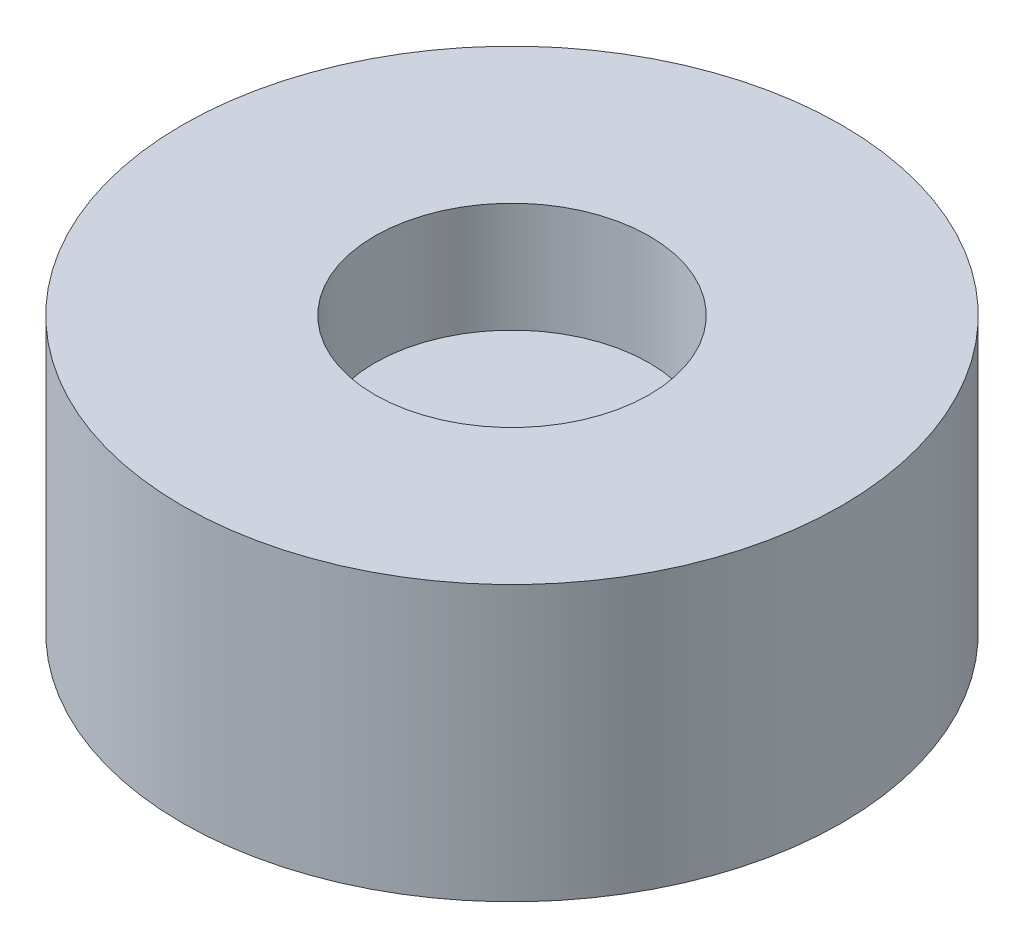
ISO-10303-21;
HEADER;
FILE_DESCRIPTION(('STEP AP214'),'2;1');
FILE_NAME('part.step','',(''),(''),'','','');
FILE_SCHEMA(('AUTOMOTIVE_DESIGN { 1 0 10303 214 1 1 1 1 }'));
ENDSEC;
DATA;
#1=APPLICATION_CONTEXT('core data for automotive mechanical design processes');
#2=APPLICATION_PROTOCOL_DEFINITION('international standard','automotive_design',2000,#1);
#3=PRODUCT_CONTEXT('',#1,'mechanical');
#4=PRODUCT('Part','Part','',(#3));
#5=PRODUCT_RELATED_PRODUCT_CATEGORY('part','',(#4));
#6=PRODUCT_DEFINITION_FORMATION('','',#4);
#7=PRODUCT_DEFINITION_CONTEXT('part definition',#1,'design');
#8=PRODUCT_DEFINITION('design','',#6,#7);
#9=PRODUCT_DEFINITION_SHAPE('','',#8);
#10=(LENGTH_UNIT() NAMED_UNIT(*) SI_UNIT(.MILLI.,.METRE.));
#11=(NAMED_UNIT(*) PLANE_ANGLE_UNIT() SI_UNIT($,.RADIAN.));
#12=(NAMED_UNIT(*) SI_UNIT($,.STERADIAN.) SOLID_ANGLE_UNIT());
#13=UNCERTAINTY_MEASURE_WITH_UNIT(LENGTH_MEASURE(1.E-05),#10,'distance_accuracy_value','');
#14=(GEOMETRIC_REPRESENTATION_CONTEXT(3) GLOBAL_UNCERTAINTY_ASSIGNED_CONTEXT((#13)) GLOBAL_UNIT_ASSIGNED_CONTEXT((#10,
#11,#12)) REPRESENTATION_CONTEXT('',''));
#15=CARTESIAN_POINT('',(0.,0.,0.));
#16=DIRECTION('',(0.,0.,1.));
#17=DIRECTION('',(1.,0.,0.));
#18=AXIS2_PLACEMENT_3D('',#15,#16,#17);
#19=CARTESIAN_POINT('',(0.,5.,0.));
#20=DIRECTION('',(0.,-1.,0.));
#21=DIRECTION('',(0.,0.,-1.));
#22=AXIS2_PLACEMENT_3D('',#19,#20,#21);
#23=CYLINDRICAL_SURFACE('',#22,6.);
#24=CARTESIAN_POINT('',(0.,5.,0.));
#25=DIRECTION('',(0.,1.,0.));
#26=DIRECTION('',(0.,0.,1.));
#27=AXIS2_PLACEMENT_3D('',#24,#25,#26);
#28=CIRCLE('',#27,6.);
#29=CARTESIAN_POINT('',(0.,5.,6.));
#30=VERTEX_POINT('',#29);
#31=EDGE_CURVE('E38',#30,#30,#28,.T.);
#32=ORIENTED_EDGE('',*,*,#31,.F.);
#33=EDGE_LOOP('',(#32));
#34=FACE_BOUND('',#33,.T.);
#35=CARTESIAN_POINT('',(0.,0.,0.));
#36=DIRECTION('',(0.,1.,0.));
#37=DIRECTION('',(0.,0.,1.));
#38=AXIS2_PLACEMENT_3D('',#35,#36,#37);
#39=CIRCLE('',#38,6.);
#40=CARTESIAN_POINT('',(0.,0.,6.));
#41=VERTEX_POINT('',#40);
#42=EDGE_CURVE('E42',#41,#41,#39,.T.);
#43=ORIENTED_EDGE('',*,*,#42,.T.);
#44=EDGE_LOOP('',(#43));
#45=FACE_BOUND('',#44,.T.);
#46=ADVANCED_FACE('F31',(#34,#45),#23,.T.);
#47=CARTESIAN_POINT('',(0.,5.,0.));
#48=DIRECTION('',(0.,1.,0.));
#49=DIRECTION('',(0.,0.,1.));
#50=AXIS2_PLACEMENT_3D('',#47,#48,#49);
#51=PLANE('',#50);
#52=CARTESIAN_POINT('',(0.,5.,0.));
#53=DIRECTION('',(0.,1.,0.));
#54=DIRECTION('',(0.,0.,1.));
#55=AXIS2_PLACEMENT_3D('',#52,#53,#54);
#56=CIRCLE('',#55,2.5);
#57=CARTESIAN_POINT('',(0.,5.,2.5));
#58=VERTEX_POINT('',#57);
#59=EDGE_CURVE('E49',#58,#58,#56,.T.);
#60=ORIENTED_EDGE('',*,*,#59,.F.);
#61=EDGE_LOOP('',(#60));
#62=FACE_BOUND('',#61,.T.);
#63=ORIENTED_EDGE('',*,*,#31,.T.);
#64=EDGE_LOOP('',(#63));
#65=FACE_BOUND('',#64,.T.);
#66=ADVANCED_FACE('F64',(#62,#65),#51,.T.);
#67=CARTESIAN_POINT('',(0.,0.,0.));
#68=DIRECTION('',(0.,1.,0.));
#69=DIRECTION('',(0.,0.,1.));
#70=AXIS2_PLACEMENT_3D('',#67,#68,#69);
#71=PLANE('',#70);
#72=CARTESIAN_POINT('',(0.,0.,0.));
#73=DIRECTION('',(0.,-1.,0.));
#74=DIRECTION('',(0.,0.,-1.));
#75=AXIS2_PLACEMENT_3D('',#72,#73,#74);
#76=CIRCLE('',#75,1.);
#77=CARTESIAN_POINT('',(0.,0.,-1.));
#78=VERTEX_POINT('',#77);
#79=EDGE_CURVE('E52',#78,#78,#76,.T.);
#80=ORIENTED_EDGE('',*,*,#79,.F.);
#81=EDGE_LOOP('',(#80));
#82=FACE_BOUND('',#81,.T.);
#83=ORIENTED_EDGE('',*,*,#42,.F.);
#84=EDGE_LOOP('',(#83));
#85=FACE_BOUND('',#84,.T.);
#86=ADVANCED_FACE('F60',(#82,#85),#71,.F.);
#87=CARTESIAN_POINT('',(0.,3.,0.));
#88=DIRECTION('',(0.,1.,0.));
#89=DIRECTION('',(0.,0.,1.));
#90=AXIS2_PLACEMENT_3D('',#87,#88,#89);
#91=CYLINDRICAL_SURFACE('',#90,2.5);
#92=CARTESIAN_POINT('',(0.,3.,0.));
#93=DIRECTION('',(0.,1.,0.));
#94=DIRECTION('',(0.,0.,1.));
#95=AXIS2_PLACEMENT_3D('',#92,#93,#94);
#96=CIRCLE('',#95,2.5);
#97=CARTESIAN_POINT('',(0.,3.,2.5));
#98=VERTEX_POINT('',#97);
#99=EDGE_CURVE('E47',#98,#98,#96,.T.);
#100=ORIENTED_EDGE('',*,*,#99,.F.);
#101=EDGE_LOOP('',(#100));
#102=FACE_BOUND('',#101,.T.);
#103=ORIENTED_EDGE('',*,*,#59,.T.);
#104=EDGE_LOOP('',(#103));
#105=FACE_BOUND('',#104,.T.);
#106=ADVANCED_FACE('F63',(#102,#105),#91,.F.);
#107=CARTESIAN_POINT('',(0.,3.,0.));
#108=DIRECTION('',(0.,1.,0.));
#109=DIRECTION('',(0.,0.,1.));
#110=AXIS2_PLACEMENT_3D('',#107,#108,#109);
#111=PLANE('',#110);
#112=ORIENTED_EDGE('',*,*,#99,.T.);
#113=EDGE_LOOP('',(#112));
#114=FACE_BOUND('',#113,.T.);
#115=ADVANCED_FACE('F78',(#114),#111,.T.);
#116=CARTESIAN_POINT('',(0.,2.,0.));
#117=DIRECTION('',(0.,-1.,0.));
#118=DIRECTION('',(0.,0.,-1.));
#119=AXIS2_PLACEMENT_3D('',#116,#117,#118);
#120=CYLINDRICAL_SURFACE('',#119,1.);
#121=CARTESIAN_POINT('',(0.,1.,0.));
#122=DIRECTION('',(0.,-1.,0.));
#123=DIRECTION('',(0.,0.,-1.));
#124=AXIS2_PLACEMENT_3D('',#121,#122,#123);
#125=CIRCLE('',#124,1.);
#126=CARTESIAN_POINT('',(0.,1.,-1.));
#127=VERTEX_POINT('',#126);
#128=EDGE_CURVE('E10',#127,#127,#125,.F.);
#129=ORIENTED_EDGE('',*,*,#128,.T.);
#130=EDGE_LOOP('',(#129));
#131=FACE_BOUND('',#130,.T.);
#132=ORIENTED_EDGE('',*,*,#79,.T.);
#133=EDGE_LOOP('',(#132));
#134=FACE_BOUND('',#133,.T.);
#135=ADVANCED_FACE('F58',(#131,#134),#120,.F.);
#136=CARTESIAN_POINT('',(0.,1.,0.));
#137=DIRECTION('',(0.,-1.,0.));
#138=DIRECTION('',(0.,0.,-1.));
#139=AXIS2_PLACEMENT_3D('',#136,#137,#138);
#140=SPHERICAL_SURFACE('',#139,1.);
#141=ORIENTED_EDGE('',*,*,#128,.F.);
#142=EDGE_LOOP('',(#141));
#143=FACE_BOUND('',#142,.T.);
#144=ADVANCED_FACE('F33',(#143),#140,.F.);
#145=CLOSED_SHELL('',(#46,#66,#86,#106,#115,#135,#144));
#146=MANIFOLD_SOLID_BREP('B2',#145);
#147=ADVANCED_BREP_SHAPE_REPRESENTATION('',(#18,#146),#14);
#148=SHAPE_DEFINITION_REPRESENTATION(#9,#147);
ENDSEC;
END-ISO-10303-21;
